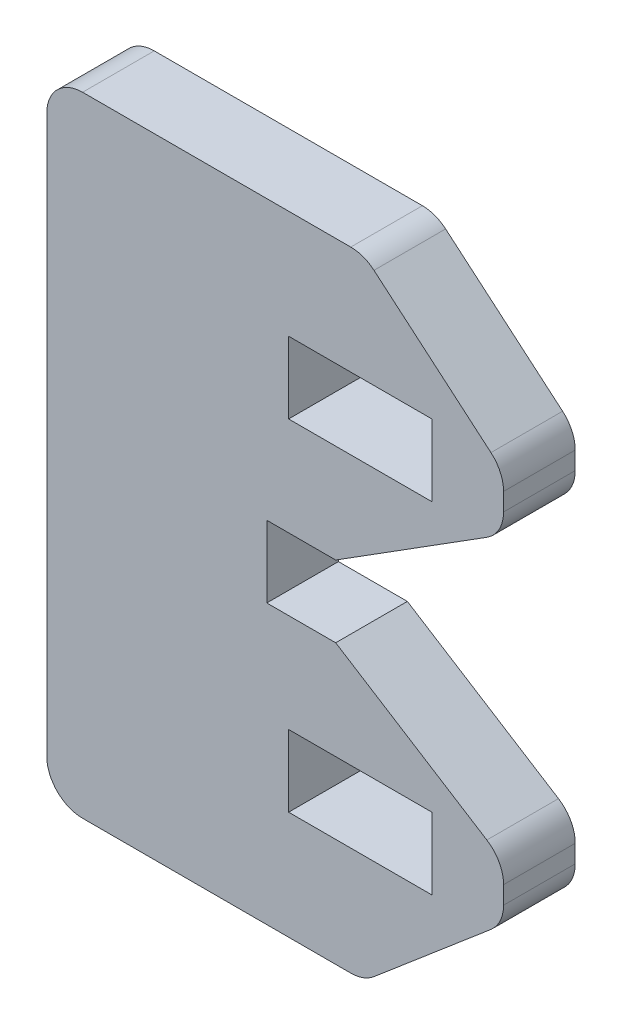
ISO-10303-21;
HEADER;
FILE_DESCRIPTION(('STEP AP214'),'2;1');
FILE_NAME('part.step','',(''),(''),'','','');
FILE_SCHEMA(('AUTOMOTIVE_DESIGN { 1 0 10303 214 1 1 1 1 }'));
ENDSEC;
DATA;
#1=APPLICATION_CONTEXT('core data for automotive mechanical design processes');
#2=APPLICATION_PROTOCOL_DEFINITION('international standard','automotive_design',2000,#1);
#3=PRODUCT_CONTEXT('',#1,'mechanical');
#4=PRODUCT('Part','Part','',(#3));
#5=PRODUCT_RELATED_PRODUCT_CATEGORY('part','',(#4));
#6=PRODUCT_DEFINITION_FORMATION('','',#4);
#7=PRODUCT_DEFINITION_CONTEXT('part definition',#1,'design');
#8=PRODUCT_DEFINITION('design','',#6,#7);
#9=PRODUCT_DEFINITION_SHAPE('','',#8);
#10=(LENGTH_UNIT() NAMED_UNIT(*) SI_UNIT(.MILLI.,.METRE.));
#11=(NAMED_UNIT(*) PLANE_ANGLE_UNIT() SI_UNIT($,.RADIAN.));
#12=(NAMED_UNIT(*) SI_UNIT($,.STERADIAN.) SOLID_ANGLE_UNIT());
#13=UNCERTAINTY_MEASURE_WITH_UNIT(LENGTH_MEASURE(1.E-05),#10,'distance_accuracy_value','');
#14=(GEOMETRIC_REPRESENTATION_CONTEXT(3) GLOBAL_UNCERTAINTY_ASSIGNED_CONTEXT((#13)) GLOBAL_UNIT_ASSIGNED_CONTEXT((#10,
#11,#12)) REPRESENTATION_CONTEXT('',''));
#15=CARTESIAN_POINT('',(0.,0.,0.));
#16=DIRECTION('',(0.,0.,1.));
#17=DIRECTION('',(1.,0.,0.));
#18=AXIS2_PLACEMENT_3D('',#15,#16,#17);
#19=CARTESIAN_POINT('',(75.9087412259888,2.67038995588559,1.524));
#20=DIRECTION('',(0.,0.,1.));
#21=DIRECTION('',(1.,0.,0.));
#22=AXIS2_PLACEMENT_3D('',#19,#20,#21);
#23=PLANE('',#22);
#24=DIRECTION('',(1.,0.,0.));
#25=VECTOR('',#24,1.);
#26=CARTESIAN_POINT('',(75.1467412259888,-5.14564233565694,1.524));
#27=LINE('',#26,#25);
#28=CARTESIAN_POINT('',(72.0987412259888,-5.14564233565695,1.524));
#29=VERTEX_POINT('',#28);
#30=CARTESIAN_POINT('',(75.1467412259888,-5.14564233565694,1.524));
#31=VERTEX_POINT('',#30);
#32=EDGE_CURVE('E255',#29,#31,#27,.T.);
#33=ORIENTED_EDGE('',*,*,#32,.F.);
#34=DIRECTION('',(0.,-1.,0.));
#35=VECTOR('',#34,1.);
#36=CARTESIAN_POINT('',(72.0987412259888,-5.14564233565695,1.524));
#37=LINE('',#36,#35);
#38=CARTESIAN_POINT('',(72.0987412259888,-3.62164233565695,1.524));
#39=VERTEX_POINT('',#38);
#40=EDGE_CURVE('E253',#39,#29,#37,.T.);
#41=ORIENTED_EDGE('',*,*,#40,.F.);
#42=DIRECTION('',(-1.,0.,0.));
#43=VECTOR('',#42,1.);
#44=CARTESIAN_POINT('',(75.1467412259888,-3.62164233565694,1.524));
#45=LINE('',#44,#43);
#46=CARTESIAN_POINT('',(75.1467412259888,-3.62164233565694,1.524));
#47=VERTEX_POINT('',#46);
#48=EDGE_CURVE('E261',#47,#39,#45,.T.);
#49=ORIENTED_EDGE('',*,*,#48,.F.);
#50=DIRECTION('',(0.,1.,0.));
#51=VECTOR('',#50,1.);
#52=CARTESIAN_POINT('',(75.1467412259888,-5.14564233565694,1.524));
#53=LINE('',#52,#51);
#54=EDGE_CURVE('E258',#31,#47,#53,.T.);
#55=ORIENTED_EDGE('',*,*,#54,.F.);
#56=EDGE_LOOP('',(#33,#41,#49,#55));
#57=FACE_BOUND('',#56,.T.);
#58=DIRECTION('',(0.,1.,0.));
#59=VECTOR('',#58,1.);
#60=CARTESIAN_POINT('',(71.6339660284306,-1.524,1.524));
#61=LINE('',#60,#59);
#62=CARTESIAN_POINT('',(71.6339660284306,-1.524,1.524));
#63=VERTEX_POINT('',#62);
#64=CARTESIAN_POINT('',(71.6339660284306,0.,1.524));
#65=VERTEX_POINT('',#64);
#66=EDGE_CURVE('E284',#63,#65,#61,.T.);
#67=ORIENTED_EDGE('',*,*,#66,.T.);
#68=DIRECTION('',(1.,0.,0.));
#69=VECTOR('',#68,1.);
#70=CARTESIAN_POINT('',(73.1003700758274,0.,1.524));
#71=LINE('',#70,#69);
#72=CARTESIAN_POINT('',(73.1003700758274,0.,1.524));
#73=VERTEX_POINT('',#72);
#74=EDGE_CURVE('E287',#65,#73,#71,.T.);
#75=ORIENTED_EDGE('',*,*,#74,.T.);
#76=DIRECTION('',(0.846031649720717,0.533132673610277,0.));
#77=VECTOR('',#76,1.);
#78=CARTESIAN_POINT('',(73.1003700758274,0.,1.524));
#79=LINE('',#78,#77);
#80=CARTESIAN_POINT('',(76.3149883232798,2.0257138387984,1.524));
#81=VERTEX_POINT('',#80);
#82=EDGE_CURVE('E290',#73,#81,#79,.T.);
#83=ORIENTED_EDGE('',*,*,#82,.T.);
#84=CARTESIAN_POINT('',(75.9087412259888,2.67038995588559,1.524));
#85=DIRECTION('',(0.,0.,1.));
#86=DIRECTION('',(1.,0.,0.));
#87=AXIS2_PLACEMENT_3D('',#84,#85,#86);
#88=CIRCLE('',#87,0.762000000000007);
#89=CARTESIAN_POINT('',(76.6707412259888,2.67038995588559,1.524));
#90=VERTEX_POINT('',#89);
#91=EDGE_CURVE('E292',#81,#90,#88,.T.);
#92=ORIENTED_EDGE('',*,*,#91,.T.);
#93=DIRECTION('',(0.,1.,0.));
#94=VECTOR('',#93,1.);
#95=CARTESIAN_POINT('',(76.6707412259888,2.67038995588559,1.524));
#96=LINE('',#95,#94);
#97=CARTESIAN_POINT('',(76.6707412259888,3.0488947154283,1.524));
#98=VERTEX_POINT('',#97);
#99=EDGE_CURVE('E294',#90,#98,#96,.T.);
#100=ORIENTED_EDGE('',*,*,#99,.T.);
#101=CARTESIAN_POINT('',(75.9087412259888,3.0488947154283,1.524));
#102=DIRECTION('',(0.,0.,1.));
#103=DIRECTION('',(1.,0.,0.));
#104=AXIS2_PLACEMENT_3D('',#101,#102,#103);
#105=CIRCLE('',#104,0.762000000000005);
#106=CARTESIAN_POINT('',(76.4021208794432,3.62960162735309,1.524));
#107=VERTEX_POINT('',#106);
#108=EDGE_CURVE('E296',#98,#107,#105,.T.);
#109=ORIENTED_EDGE('',*,*,#108,.T.);
#110=DIRECTION('',(-0.76208256158109,0.647479860176364,0.));
#111=VECTOR('',#110,1.);
#112=CARTESIAN_POINT('',(76.4021208794432,3.62960162735309,1.524));
#113=LINE('',#112,#111);
#114=CARTESIAN_POINT('',(73.9140783185866,5.74348997833968,1.524));
#115=VERTEX_POINT('',#114);
#116=EDGE_CURVE('E298',#107,#115,#113,.T.);
#117=ORIENTED_EDGE('',*,*,#116,.T.);
#118=CARTESIAN_POINT('',(73.4206986651322,5.16278306641489,1.524));
#119=DIRECTION('',(0.,0.,1.));
#120=DIRECTION('',(1.,0.,0.));
#121=AXIS2_PLACEMENT_3D('',#118,#119,#120);
#122=CIRCLE('',#121,0.762000000000003);
#123=CARTESIAN_POINT('',(73.4206986651322,5.92478306641488,1.524));
#124=VERTEX_POINT('',#123);
#125=EDGE_CURVE('E300',#115,#124,#122,.T.);
#126=ORIENTED_EDGE('',*,*,#125,.T.);
#127=DIRECTION('',(-1.,0.,0.));
#128=VECTOR('',#127,1.);
#129=CARTESIAN_POINT('',(73.4206986651322,5.92478306641488,1.524));
#130=LINE('',#129,#128);
#131=CARTESIAN_POINT('',(67.7169854717539,5.92478306641489,1.524));
#132=VERTEX_POINT('',#131);
#133=EDGE_CURVE('E302',#124,#132,#130,.T.);
#134=ORIENTED_EDGE('',*,*,#133,.T.);
#135=CARTESIAN_POINT('',(67.7169854717539,5.16278306641489,1.524));
#136=DIRECTION('',(0.,0.,1.));
#137=DIRECTION('',(1.,0.,0.));
#138=AXIS2_PLACEMENT_3D('',#135,#136,#137);
#139=CIRCLE('',#138,0.761999999999999);
#140=CARTESIAN_POINT('',(66.9549854717539,5.16278306641489,1.524));
#141=VERTEX_POINT('',#140);
#142=EDGE_CURVE('E304',#132,#141,#139,.T.);
#143=ORIENTED_EDGE('',*,*,#142,.T.);
#144=DIRECTION('',(0.,-1.,0.));
#145=VECTOR('',#144,1.);
#146=CARTESIAN_POINT('',(66.9549854717539,5.16278306641489,1.524));
#147=LINE('',#146,#145);
#148=CARTESIAN_POINT('',(66.9549854717539,-6.68678306641489,1.524));
#149=VERTEX_POINT('',#148);
#150=EDGE_CURVE('E306',#141,#149,#147,.T.);
#151=ORIENTED_EDGE('',*,*,#150,.T.);
#152=CARTESIAN_POINT('',(67.7169854717539,-6.6867830664149,1.524));
#153=DIRECTION('',(0.,0.,1.));
#154=DIRECTION('',(-1.,0.,0.));
#155=AXIS2_PLACEMENT_3D('',#152,#153,#154);
#156=CIRCLE('',#155,0.761999999999998);
#157=CARTESIAN_POINT('',(67.7169854717539,-7.44878306641489,1.524));
#158=VERTEX_POINT('',#157);
#159=EDGE_CURVE('E308',#149,#158,#156,.T.);
#160=ORIENTED_EDGE('',*,*,#159,.T.);
#161=DIRECTION('',(1.,0.,0.));
#162=VECTOR('',#161,1.);
#163=CARTESIAN_POINT('',(73.4206986651322,-7.44878306641489,1.524));
#164=LINE('',#163,#162);
#165=CARTESIAN_POINT('',(73.4206986651322,-7.4487830664149,1.524));
#166=VERTEX_POINT('',#165);
#167=EDGE_CURVE('E310',#158,#166,#164,.T.);
#168=ORIENTED_EDGE('',*,*,#167,.T.);
#169=CARTESIAN_POINT('',(73.4206986651322,-6.68678306641489,1.524));
#170=DIRECTION('',(0.,0.,1.));
#171=DIRECTION('',(-1.,0.,0.));
#172=AXIS2_PLACEMENT_3D('',#169,#170,#171);
#173=CIRCLE('',#172,0.762000000000009);
#174=CARTESIAN_POINT('',(73.9140783185866,-7.26748997833969,1.524));
#175=VERTEX_POINT('',#174);
#176=EDGE_CURVE('E312',#166,#175,#173,.T.);
#177=ORIENTED_EDGE('',*,*,#176,.T.);
#178=DIRECTION('',(0.762082561581091,0.647479860176363,0.));
#179=VECTOR('',#178,1.);
#180=CARTESIAN_POINT('',(76.4021208794432,-5.1536016273531,1.524));
#181=LINE('',#180,#179);
#182=CARTESIAN_POINT('',(76.4021208794432,-5.15360162735309,1.524));
#183=VERTEX_POINT('',#182);
#184=EDGE_CURVE('E314',#175,#183,#181,.T.);
#185=ORIENTED_EDGE('',*,*,#184,.T.);
#186=CARTESIAN_POINT('',(75.9087412259888,-4.5728947154283,1.524));
#187=DIRECTION('',(0.,0.,1.));
#188=DIRECTION('',(-1.,0.,0.));
#189=AXIS2_PLACEMENT_3D('',#186,#187,#188);
#190=CIRCLE('',#189,0.762000000000002);
#191=CARTESIAN_POINT('',(76.6707412259888,-4.5728947154283,1.524));
#192=VERTEX_POINT('',#191);
#193=EDGE_CURVE('E316',#183,#192,#190,.T.);
#194=ORIENTED_EDGE('',*,*,#193,.T.);
#195=DIRECTION('',(0.,1.,0.));
#196=VECTOR('',#195,1.);
#197=CARTESIAN_POINT('',(76.6707412259888,-4.19438995588559,1.524));
#198=LINE('',#197,#196);
#199=CARTESIAN_POINT('',(76.6707412259888,-4.19438995588559,1.524));
#200=VERTEX_POINT('',#199);
#201=EDGE_CURVE('E318',#192,#200,#198,.T.);
#202=ORIENTED_EDGE('',*,*,#201,.T.);
#203=CARTESIAN_POINT('',(75.9087412259888,-4.19438995588559,1.524));
#204=DIRECTION('',(0.,0.,1.));
#205=DIRECTION('',(-1.,0.,0.));
#206=AXIS2_PLACEMENT_3D('',#203,#204,#205);
#207=CIRCLE('',#206,0.762);
#208=CARTESIAN_POINT('',(76.3149883232798,-3.5497138387984,1.524));
#209=VERTEX_POINT('',#208);
#210=EDGE_CURVE('E320',#200,#209,#207,.T.);
#211=ORIENTED_EDGE('',*,*,#210,.T.);
#212=DIRECTION('',(-0.846031649720717,0.533132673610277,0.));
#213=VECTOR('',#212,1.);
#214=CARTESIAN_POINT('',(73.1003700758274,-1.524,1.524));
#215=LINE('',#214,#213);
#216=CARTESIAN_POINT('',(73.1003700758274,-1.524,1.524));
#217=VERTEX_POINT('',#216);
#218=EDGE_CURVE('E322',#209,#217,#215,.T.);
#219=ORIENTED_EDGE('',*,*,#218,.T.);
#220=DIRECTION('',(-1.,0.,0.));
#221=VECTOR('',#220,1.);
#222=CARTESIAN_POINT('',(71.6339660284306,-1.524,1.524));
#223=LINE('',#222,#221);
#224=EDGE_CURVE('E324',#217,#63,#223,.T.);
#225=ORIENTED_EDGE('',*,*,#224,.T.);
#226=EDGE_LOOP('',(#67,#75,#83,#92,#100,#109,#117,#126,#134,#143,#151,#160,#168,#177,#185,#194,
#202,#211,#219,#225));
#227=FACE_BOUND('',#226,.T.);
#228=DIRECTION('',(0.,-1.,0.));
#229=VECTOR('',#228,1.);
#230=CARTESIAN_POINT('',(72.0987412259888,3.62164233565694,1.524));
#231=LINE('',#230,#229);
#232=CARTESIAN_POINT('',(72.0987412259888,3.62164233565694,1.524));
#233=VERTEX_POINT('',#232);
#234=CARTESIAN_POINT('',(72.0987412259888,2.09764233565695,1.524));
#235=VERTEX_POINT('',#234);
#236=EDGE_CURVE('E225',#233,#235,#231,.T.);
#237=ORIENTED_EDGE('',*,*,#236,.F.);
#238=DIRECTION('',(-1.,0.,0.));
#239=VECTOR('',#238,1.);
#240=CARTESIAN_POINT('',(75.1467412259888,3.62164233565694,1.524));
#241=LINE('',#240,#239);
#242=CARTESIAN_POINT('',(75.1467412259888,3.62164233565694,1.524));
#243=VERTEX_POINT('',#242);
#244=EDGE_CURVE('E217',#243,#233,#241,.T.);
#245=ORIENTED_EDGE('',*,*,#244,.F.);
#246=DIRECTION('',(0.,1.,0.));
#247=VECTOR('',#246,1.);
#248=CARTESIAN_POINT('',(75.1467412259888,3.62164233565694,1.524));
#249=LINE('',#248,#247);
#250=CARTESIAN_POINT('',(75.1467412259888,2.09764233565694,1.524));
#251=VERTEX_POINT('',#250);
#252=EDGE_CURVE('E239',#251,#243,#249,.T.);
#253=ORIENTED_EDGE('',*,*,#252,.F.);
#254=DIRECTION('',(1.,0.,0.));
#255=VECTOR('',#254,1.);
#256=CARTESIAN_POINT('',(75.1467412259888,2.09764233565694,1.524));
#257=LINE('',#256,#255);
#258=EDGE_CURVE('E237',#235,#251,#257,.T.);
#259=ORIENTED_EDGE('',*,*,#258,.F.);
#260=EDGE_LOOP('',(#237,#245,#253,#259));
#261=FACE_BOUND('',#260,.T.);
#262=ADVANCED_FACE('F32',(#57,#227,#261),#23,.T.);
#263=CARTESIAN_POINT('',(75.9087412259888,2.67038995588559,0.));
#264=DIRECTION('',(0.,0.,1.));
#265=DIRECTION('',(1.,0.,0.));
#266=AXIS2_PLACEMENT_3D('',#263,#264,#265);
#267=PLANE('',#266);
#268=DIRECTION('',(0.,-1.,0.));
#269=VECTOR('',#268,1.);
#270=CARTESIAN_POINT('',(72.0987412259888,-5.14564233565695,0.));
#271=LINE('',#270,#269);
#272=CARTESIAN_POINT('',(72.0987412259888,-3.62164233565695,0.));
#273=VERTEX_POINT('',#272);
#274=CARTESIAN_POINT('',(72.0987412259888,-5.14564233565695,0.));
#275=VERTEX_POINT('',#274);
#276=EDGE_CURVE('E233',#273,#275,#271,.T.);
#277=ORIENTED_EDGE('',*,*,#276,.T.);
#278=DIRECTION('',(1.,0.,0.));
#279=VECTOR('',#278,1.);
#280=CARTESIAN_POINT('',(75.1467412259888,-5.14564233565694,0.));
#281=LINE('',#280,#279);
#282=CARTESIAN_POINT('',(75.1467412259888,-5.14564233565694,0.));
#283=VERTEX_POINT('',#282);
#284=EDGE_CURVE('E266',#275,#283,#281,.T.);
#285=ORIENTED_EDGE('',*,*,#284,.T.);
#286=DIRECTION('',(0.,1.,0.));
#287=VECTOR('',#286,1.);
#288=CARTESIAN_POINT('',(75.1467412259888,-5.14564233565694,0.));
#289=LINE('',#288,#287);
#290=CARTESIAN_POINT('',(75.1467412259888,-3.62164233565694,0.));
#291=VERTEX_POINT('',#290);
#292=EDGE_CURVE('E269',#283,#291,#289,.T.);
#293=ORIENTED_EDGE('',*,*,#292,.T.);
#294=DIRECTION('',(-1.,0.,0.));
#295=VECTOR('',#294,1.);
#296=CARTESIAN_POINT('',(75.1467412259888,-3.62164233565694,0.));
#297=LINE('',#296,#295);
#298=EDGE_CURVE('E256',#291,#273,#297,.T.);
#299=ORIENTED_EDGE('',*,*,#298,.T.);
#300=EDGE_LOOP('',(#277,#285,#293,#299));
#301=FACE_BOUND('',#300,.T.);
#302=DIRECTION('',(0.,1.,0.));
#303=VECTOR('',#302,1.);
#304=CARTESIAN_POINT('',(71.6339660284306,-1.524,0.));
#305=LINE('',#304,#303);
#306=CARTESIAN_POINT('',(71.6339660284306,-1.524,0.));
#307=VERTEX_POINT('',#306);
#308=CARTESIAN_POINT('',(71.6339660284306,0.,0.));
#309=VERTEX_POINT('',#308);
#310=EDGE_CURVE('E283',#307,#309,#305,.T.);
#311=ORIENTED_EDGE('',*,*,#310,.F.);
#312=DIRECTION('',(-1.,0.,0.));
#313=VECTOR('',#312,1.);
#314=CARTESIAN_POINT('',(71.6339660284306,-1.524,0.));
#315=LINE('',#314,#313);
#316=CARTESIAN_POINT('',(73.1003700758274,-1.524,0.));
#317=VERTEX_POINT('',#316);
#318=EDGE_CURVE('E288',#317,#307,#315,.T.);
#319=ORIENTED_EDGE('',*,*,#318,.F.);
#320=DIRECTION('',(-0.846031649720717,0.533132673610277,0.));
#321=VECTOR('',#320,1.);
#322=CARTESIAN_POINT('',(73.1003700758274,-1.524,0.));
#323=LINE('',#322,#321);
#324=CARTESIAN_POINT('',(76.3149883232798,-3.5497138387984,0.));
#325=VERTEX_POINT('',#324);
#326=EDGE_CURVE('E363',#325,#317,#323,.T.);
#327=ORIENTED_EDGE('',*,*,#326,.F.);
#328=CARTESIAN_POINT('',(75.9087412259888,-4.19438995588559,0.));
#329=DIRECTION('',(0.,0.,1.));
#330=DIRECTION('',(-1.,0.,0.));
#331=AXIS2_PLACEMENT_3D('',#328,#329,#330);
#332=CIRCLE('',#331,0.762);
#333=CARTESIAN_POINT('',(76.6707412259888,-4.19438995588559,0.));
#334=VERTEX_POINT('',#333);
#335=EDGE_CURVE('E361',#334,#325,#332,.T.);
#336=ORIENTED_EDGE('',*,*,#335,.F.);
#337=DIRECTION('',(0.,1.,0.));
#338=VECTOR('',#337,1.);
#339=CARTESIAN_POINT('',(76.6707412259888,-4.19438995588559,0.));
#340=LINE('',#339,#338);
#341=CARTESIAN_POINT('',(76.6707412259888,-4.5728947154283,0.));
#342=VERTEX_POINT('',#341);
#343=EDGE_CURVE('E359',#342,#334,#340,.T.);
#344=ORIENTED_EDGE('',*,*,#343,.F.);
#345=CARTESIAN_POINT('',(75.9087412259888,-4.5728947154283,0.));
#346=DIRECTION('',(0.,0.,1.));
#347=DIRECTION('',(-1.,0.,0.));
#348=AXIS2_PLACEMENT_3D('',#345,#346,#347);
#349=CIRCLE('',#348,0.762000000000002);
#350=CARTESIAN_POINT('',(76.4021208794432,-5.15360162735309,0.));
#351=VERTEX_POINT('',#350);
#352=EDGE_CURVE('E357',#351,#342,#349,.T.);
#353=ORIENTED_EDGE('',*,*,#352,.F.);
#354=DIRECTION('',(0.762082561581091,0.647479860176363,0.));
#355=VECTOR('',#354,1.);
#356=CARTESIAN_POINT('',(76.4021208794432,-5.1536016273531,0.));
#357=LINE('',#356,#355);
#358=CARTESIAN_POINT('',(73.9140783185866,-7.26748997833969,0.));
#359=VERTEX_POINT('',#358);
#360=EDGE_CURVE('E355',#359,#351,#357,.T.);
#361=ORIENTED_EDGE('',*,*,#360,.F.);
#362=CARTESIAN_POINT('',(73.4206986651322,-6.68678306641489,0.));
#363=DIRECTION('',(0.,0.,1.));
#364=DIRECTION('',(-1.,0.,0.));
#365=AXIS2_PLACEMENT_3D('',#362,#363,#364);
#366=CIRCLE('',#365,0.762000000000009);
#367=CARTESIAN_POINT('',(73.4206986651322,-7.4487830664149,0.));
#368=VERTEX_POINT('',#367);
#369=EDGE_CURVE('E353',#368,#359,#366,.T.);
#370=ORIENTED_EDGE('',*,*,#369,.F.);
#371=DIRECTION('',(1.,0.,0.));
#372=VECTOR('',#371,1.);
#373=CARTESIAN_POINT('',(73.4206986651322,-7.44878306641489,0.));
#374=LINE('',#373,#372);
#375=CARTESIAN_POINT('',(67.7169854717539,-7.44878306641489,0.));
#376=VERTEX_POINT('',#375);
#377=EDGE_CURVE('E351',#376,#368,#374,.T.);
#378=ORIENTED_EDGE('',*,*,#377,.F.);
#379=CARTESIAN_POINT('',(67.7169854717539,-6.6867830664149,0.));
#380=DIRECTION('',(0.,0.,1.));
#381=DIRECTION('',(-1.,0.,0.));
#382=AXIS2_PLACEMENT_3D('',#379,#380,#381);
#383=CIRCLE('',#382,0.761999999999998);
#384=CARTESIAN_POINT('',(66.9549854717539,-6.68678306641489,0.));
#385=VERTEX_POINT('',#384);
#386=EDGE_CURVE('E349',#385,#376,#383,.T.);
#387=ORIENTED_EDGE('',*,*,#386,.F.);
#388=DIRECTION('',(0.,-1.,0.));
#389=VECTOR('',#388,1.);
#390=CARTESIAN_POINT('',(66.9549854717539,5.16278306641489,0.));
#391=LINE('',#390,#389);
#392=CARTESIAN_POINT('',(66.9549854717539,5.16278306641489,0.));
#393=VERTEX_POINT('',#392);
#394=EDGE_CURVE('E347',#393,#385,#391,.T.);
#395=ORIENTED_EDGE('',*,*,#394,.F.);
#396=CARTESIAN_POINT('',(67.7169854717539,5.16278306641489,0.));
#397=DIRECTION('',(0.,0.,1.));
#398=DIRECTION('',(1.,0.,0.));
#399=AXIS2_PLACEMENT_3D('',#396,#397,#398);
#400=CIRCLE('',#399,0.761999999999999);
#401=CARTESIAN_POINT('',(67.7169854717539,5.92478306641489,0.));
#402=VERTEX_POINT('',#401);
#403=EDGE_CURVE('E345',#402,#393,#400,.T.);
#404=ORIENTED_EDGE('',*,*,#403,.F.);
#405=DIRECTION('',(-1.,0.,0.));
#406=VECTOR('',#405,1.);
#407=CARTESIAN_POINT('',(73.4206986651322,5.92478306641488,0.));
#408=LINE('',#407,#406);
#409=CARTESIAN_POINT('',(73.4206986651322,5.92478306641488,0.));
#410=VERTEX_POINT('',#409);
#411=EDGE_CURVE('E343',#410,#402,#408,.T.);
#412=ORIENTED_EDGE('',*,*,#411,.F.);
#413=CARTESIAN_POINT('',(73.4206986651322,5.16278306641489,0.));
#414=DIRECTION('',(0.,0.,1.));
#415=DIRECTION('',(1.,0.,0.));
#416=AXIS2_PLACEMENT_3D('',#413,#414,#415);
#417=CIRCLE('',#416,0.762000000000003);
#418=CARTESIAN_POINT('',(73.9140783185866,5.74348997833968,0.));
#419=VERTEX_POINT('',#418);
#420=EDGE_CURVE('E341',#419,#410,#417,.T.);
#421=ORIENTED_EDGE('',*,*,#420,.F.);
#422=DIRECTION('',(-0.76208256158109,0.647479860176364,0.));
#423=VECTOR('',#422,1.);
#424=CARTESIAN_POINT('',(76.4021208794432,3.62960162735309,0.));
#425=LINE('',#424,#423);
#426=CARTESIAN_POINT('',(76.4021208794432,3.62960162735309,0.));
#427=VERTEX_POINT('',#426);
#428=EDGE_CURVE('E339',#427,#419,#425,.T.);
#429=ORIENTED_EDGE('',*,*,#428,.F.);
#430=CARTESIAN_POINT('',(75.9087412259888,3.0488947154283,0.));
#431=DIRECTION('',(0.,0.,1.));
#432=DIRECTION('',(1.,0.,0.));
#433=AXIS2_PLACEMENT_3D('',#430,#431,#432);
#434=CIRCLE('',#433,0.762000000000005);
#435=CARTESIAN_POINT('',(76.6707412259888,3.0488947154283,0.));
#436=VERTEX_POINT('',#435);
#437=EDGE_CURVE('E337',#436,#427,#434,.T.);
#438=ORIENTED_EDGE('',*,*,#437,.F.);
#439=DIRECTION('',(0.,1.,0.));
#440=VECTOR('',#439,1.);
#441=CARTESIAN_POINT('',(76.6707412259888,2.67038995588559,0.));
#442=LINE('',#441,#440);
#443=CARTESIAN_POINT('',(76.6707412259888,2.67038995588559,0.));
#444=VERTEX_POINT('',#443);
#445=EDGE_CURVE('E335',#444,#436,#442,.T.);
#446=ORIENTED_EDGE('',*,*,#445,.F.);
#447=CARTESIAN_POINT('',(75.9087412259888,2.67038995588559,0.));
#448=DIRECTION('',(0.,0.,1.));
#449=DIRECTION('',(1.,0.,0.));
#450=AXIS2_PLACEMENT_3D('',#447,#448,#449);
#451=CIRCLE('',#450,0.762000000000007);
#452=CARTESIAN_POINT('',(76.3149883232798,2.0257138387984,0.));
#453=VERTEX_POINT('',#452);
#454=EDGE_CURVE('E333',#453,#444,#451,.T.);
#455=ORIENTED_EDGE('',*,*,#454,.F.);
#456=DIRECTION('',(0.846031649720717,0.533132673610277,0.));
#457=VECTOR('',#456,1.);
#458=CARTESIAN_POINT('',(73.1003700758274,0.,0.));
#459=LINE('',#458,#457);
#460=CARTESIAN_POINT('',(73.1003700758274,0.,0.));
#461=VERTEX_POINT('',#460);
#462=EDGE_CURVE('E331',#461,#453,#459,.T.);
#463=ORIENTED_EDGE('',*,*,#462,.F.);
#464=DIRECTION('',(1.,0.,0.));
#465=VECTOR('',#464,1.);
#466=CARTESIAN_POINT('',(73.1003700758274,0.,0.));
#467=LINE('',#466,#465);
#468=EDGE_CURVE('E329',#309,#461,#467,.T.);
#469=ORIENTED_EDGE('',*,*,#468,.F.);
#470=EDGE_LOOP('',(#311,#319,#327,#336,#344,#353,#361,#370,#378,#387,#395,#404,#412,#421,#429,
#438,#446,#455,#463,#469));
#471=FACE_BOUND('',#470,.T.);
#472=DIRECTION('',(-1.,0.,0.));
#473=VECTOR('',#472,1.);
#474=CARTESIAN_POINT('',(75.1467412259888,3.62164233565694,0.));
#475=LINE('',#474,#473);
#476=CARTESIAN_POINT('',(75.1467412259888,3.62164233565694,0.));
#477=VERTEX_POINT('',#476);
#478=CARTESIAN_POINT('',(72.0987412259888,3.62164233565694,0.));
#479=VERTEX_POINT('',#478);
#480=EDGE_CURVE('E55',#477,#479,#475,.T.);
#481=ORIENTED_EDGE('',*,*,#480,.T.);
#482=DIRECTION('',(0.,-1.,0.));
#483=VECTOR('',#482,1.);
#484=CARTESIAN_POINT('',(72.0987412259888,3.62164233565694,0.));
#485=LINE('',#484,#483);
#486=CARTESIAN_POINT('',(72.0987412259888,2.09764233565695,0.));
#487=VERTEX_POINT('',#486);
#488=EDGE_CURVE('E232',#479,#487,#485,.T.);
#489=ORIENTED_EDGE('',*,*,#488,.T.);
#490=DIRECTION('',(1.,0.,0.));
#491=VECTOR('',#490,1.);
#492=CARTESIAN_POINT('',(75.1467412259888,2.09764233565694,0.));
#493=LINE('',#492,#491);
#494=CARTESIAN_POINT('',(75.1467412259888,2.09764233565694,0.));
#495=VERTEX_POINT('',#494);
#496=EDGE_CURVE('E245',#487,#495,#493,.T.);
#497=ORIENTED_EDGE('',*,*,#496,.T.);
#498=DIRECTION('',(0.,1.,0.));
#499=VECTOR('',#498,1.);
#500=CARTESIAN_POINT('',(75.1467412259888,3.62164233565694,0.));
#501=LINE('',#500,#499);
#502=EDGE_CURVE('E226',#495,#477,#501,.T.);
#503=ORIENTED_EDGE('',*,*,#502,.T.);
#504=EDGE_LOOP('',(#481,#489,#497,#503));
#505=FACE_BOUND('',#504,.T.);
#506=ADVANCED_FACE('F429',(#301,#471,#505),#267,.F.);
#507=CARTESIAN_POINT('',(71.6339660284306,-1.524,1.524));
#508=DIRECTION('',(-1.,0.,0.));
#509=DIRECTION('',(0.,0.,1.));
#510=AXIS2_PLACEMENT_3D('',#507,#508,#509);
#511=PLANE('',#510);
#512=ORIENTED_EDGE('',*,*,#310,.T.);
#513=DIRECTION('',(0.,0.,-1.));
#514=VECTOR('',#513,1.);
#515=CARTESIAN_POINT('',(71.6339660284306,0.,1.524));
#516=LINE('',#515,#514);
#517=EDGE_CURVE('E11',#65,#309,#516,.T.);
#518=ORIENTED_EDGE('',*,*,#517,.F.);
#519=ORIENTED_EDGE('',*,*,#66,.F.);
#520=DIRECTION('',(0.,0.,-1.));
#521=VECTOR('',#520,1.);
#522=CARTESIAN_POINT('',(71.6339660284306,-1.524,1.524));
#523=LINE('',#522,#521);
#524=EDGE_CURVE('E326',#63,#307,#523,.T.);
#525=ORIENTED_EDGE('',*,*,#524,.T.);
#526=EDGE_LOOP('',(#512,#518,#519,#525));
#527=FACE_BOUND('',#526,.T.);
#528=ADVANCED_FACE('F34',(#527),#511,.F.);
#529=CARTESIAN_POINT('',(73.1003700758274,0.,1.524));
#530=DIRECTION('',(0.,1.,0.));
#531=DIRECTION('',(-1.,0.,0.));
#532=AXIS2_PLACEMENT_3D('',#529,#530,#531);
#533=PLANE('',#532);
#534=ORIENTED_EDGE('',*,*,#468,.T.);
#535=DIRECTION('',(0.,0.,-1.));
#536=VECTOR('',#535,1.);
#537=CARTESIAN_POINT('',(73.1003700758274,0.,1.524));
#538=LINE('',#537,#536);
#539=EDGE_CURVE('E40',#73,#461,#538,.T.);
#540=ORIENTED_EDGE('',*,*,#539,.F.);
#541=ORIENTED_EDGE('',*,*,#74,.F.);
#542=ORIENTED_EDGE('',*,*,#517,.T.);
#543=EDGE_LOOP('',(#534,#540,#541,#542));
#544=FACE_BOUND('',#543,.T.);
#545=ADVANCED_FACE('F446',(#544),#533,.F.);
#546=CARTESIAN_POINT('',(73.1003700758274,0.,1.524));
#547=DIRECTION('',(-0.533132673610277,0.846031649720717,0.));
#548=DIRECTION('',(-0.846031649720717,-0.533132673610277,0.));
#549=AXIS2_PLACEMENT_3D('',#546,#547,#548);
#550=PLANE('',#549);
#551=ORIENTED_EDGE('',*,*,#462,.T.);
#552=DIRECTION('',(0.,0.,-1.));
#553=VECTOR('',#552,1.);
#554=CARTESIAN_POINT('',(76.3149883232798,2.0257138387984,1.524));
#555=LINE('',#554,#553);
#556=EDGE_CURVE('E416',#81,#453,#555,.T.);
#557=ORIENTED_EDGE('',*,*,#556,.F.);
#558=ORIENTED_EDGE('',*,*,#82,.F.);
#559=ORIENTED_EDGE('',*,*,#539,.T.);
#560=EDGE_LOOP('',(#551,#557,#558,#559));
#561=FACE_BOUND('',#560,.T.);
#562=ADVANCED_FACE('F423',(#561),#550,.F.);
#563=CARTESIAN_POINT('',(75.9087412259888,2.67038995588559,1.524));
#564=DIRECTION('',(0.,0.,-1.));
#565=DIRECTION('',(-1.,0.,0.));
#566=AXIS2_PLACEMENT_3D('',#563,#564,#565);
#567=CYLINDRICAL_SURFACE('',#566,0.762000000000007);
#568=ORIENTED_EDGE('',*,*,#454,.T.);
#569=DIRECTION('',(0.,0.,-1.));
#570=VECTOR('',#569,1.);
#571=CARTESIAN_POINT('',(76.6707412259888,2.67038995588559,1.524));
#572=LINE('',#571,#570);
#573=EDGE_CURVE('E413',#90,#444,#572,.T.);
#574=ORIENTED_EDGE('',*,*,#573,.F.);
#575=ORIENTED_EDGE('',*,*,#91,.F.);
#576=ORIENTED_EDGE('',*,*,#556,.T.);
#577=EDGE_LOOP('',(#568,#574,#575,#576));
#578=FACE_BOUND('',#577,.T.);
#579=ADVANCED_FACE('F435',(#578),#567,.T.);
#580=CARTESIAN_POINT('',(76.6707412259888,2.67038995588559,1.524));
#581=DIRECTION('',(-1.,0.,0.));
#582=DIRECTION('',(0.,0.,1.));
#583=AXIS2_PLACEMENT_3D('',#580,#581,#582);
#584=PLANE('',#583);
#585=ORIENTED_EDGE('',*,*,#445,.T.);
#586=DIRECTION('',(0.,0.,-1.));
#587=VECTOR('',#586,1.);
#588=CARTESIAN_POINT('',(76.6707412259888,3.0488947154283,1.524));
#589=LINE('',#588,#587);
#590=EDGE_CURVE('E410',#98,#436,#589,.T.);
#591=ORIENTED_EDGE('',*,*,#590,.F.);
#592=ORIENTED_EDGE('',*,*,#99,.F.);
#593=ORIENTED_EDGE('',*,*,#573,.T.);
#594=EDGE_LOOP('',(#585,#591,#592,#593));
#595=FACE_BOUND('',#594,.T.);
#596=ADVANCED_FACE('F439',(#595),#584,.F.);
#597=CARTESIAN_POINT('',(75.9087412259888,3.0488947154283,1.524));
#598=DIRECTION('',(0.,0.,-1.));
#599=DIRECTION('',(-1.,0.,0.));
#600=AXIS2_PLACEMENT_3D('',#597,#598,#599);
#601=CYLINDRICAL_SURFACE('',#600,0.762000000000005);
#602=ORIENTED_EDGE('',*,*,#437,.T.);
#603=DIRECTION('',(0.,0.,-1.));
#604=VECTOR('',#603,1.);
#605=CARTESIAN_POINT('',(76.4021208794432,3.62960162735309,1.524));
#606=LINE('',#605,#604);
#607=EDGE_CURVE('E407',#107,#427,#606,.T.);
#608=ORIENTED_EDGE('',*,*,#607,.F.);
#609=ORIENTED_EDGE('',*,*,#108,.F.);
#610=ORIENTED_EDGE('',*,*,#590,.T.);
#611=EDGE_LOOP('',(#602,#608,#609,#610));
#612=FACE_BOUND('',#611,.T.);
#613=ADVANCED_FACE('F519',(#612),#601,.T.);
#614=CARTESIAN_POINT('',(76.4021208794432,3.62960162735309,1.524));
#615=DIRECTION('',(-0.647479860176364,-0.76208256158109,0.));
#616=DIRECTION('',(0.762082561581091,-0.647479860176364,0.));
#617=AXIS2_PLACEMENT_3D('',#614,#615,#616);
#618=PLANE('',#617);
#619=ORIENTED_EDGE('',*,*,#428,.T.);
#620=DIRECTION('',(0.,0.,-1.));
#621=VECTOR('',#620,1.);
#622=CARTESIAN_POINT('',(73.9140783185866,5.74348997833968,1.524));
#623=LINE('',#622,#621);
#624=EDGE_CURVE('E404',#115,#419,#623,.T.);
#625=ORIENTED_EDGE('',*,*,#624,.F.);
#626=ORIENTED_EDGE('',*,*,#116,.F.);
#627=ORIENTED_EDGE('',*,*,#607,.T.);
#628=EDGE_LOOP('',(#619,#625,#626,#627));
#629=FACE_BOUND('',#628,.T.);
#630=ADVANCED_FACE('F517',(#629),#618,.F.);
#631=CARTESIAN_POINT('',(73.4206986651322,5.16278306641489,1.524));
#632=DIRECTION('',(0.,0.,-1.));
#633=DIRECTION('',(-1.,0.,0.));
#634=AXIS2_PLACEMENT_3D('',#631,#632,#633);
#635=CYLINDRICAL_SURFACE('',#634,0.762000000000003);
#636=ORIENTED_EDGE('',*,*,#420,.T.);
#637=DIRECTION('',(0.,0.,-1.));
#638=VECTOR('',#637,1.);
#639=CARTESIAN_POINT('',(73.4206986651322,5.92478306641488,1.524));
#640=LINE('',#639,#638);
#641=EDGE_CURVE('E401',#124,#410,#640,.T.);
#642=ORIENTED_EDGE('',*,*,#641,.F.);
#643=ORIENTED_EDGE('',*,*,#125,.F.);
#644=ORIENTED_EDGE('',*,*,#624,.T.);
#645=EDGE_LOOP('',(#636,#642,#643,#644));
#646=FACE_BOUND('',#645,.T.);
#647=ADVANCED_FACE('F512',(#646),#635,.T.);
#648=CARTESIAN_POINT('',(73.4206986651322,5.92478306641488,1.524));
#649=DIRECTION('',(0.,-1.,0.));
#650=DIRECTION('',(1.,0.,0.));
#651=AXIS2_PLACEMENT_3D('',#648,#649,#650);
#652=PLANE('',#651);
#653=ORIENTED_EDGE('',*,*,#411,.T.);
#654=DIRECTION('',(0.,0.,-1.));
#655=VECTOR('',#654,1.);
#656=CARTESIAN_POINT('',(67.7169854717539,5.92478306641489,1.524));
#657=LINE('',#656,#655);
#658=EDGE_CURVE('E398',#132,#402,#657,.T.);
#659=ORIENTED_EDGE('',*,*,#658,.F.);
#660=ORIENTED_EDGE('',*,*,#133,.F.);
#661=ORIENTED_EDGE('',*,*,#641,.T.);
#662=EDGE_LOOP('',(#653,#659,#660,#661));
#663=FACE_BOUND('',#662,.T.);
#664=ADVANCED_FACE('F507',(#663),#652,.F.);
#665=CARTESIAN_POINT('',(67.7169854717539,5.16278306641489,1.524));
#666=DIRECTION('',(0.,0.,-1.));
#667=DIRECTION('',(-1.,0.,0.));
#668=AXIS2_PLACEMENT_3D('',#665,#666,#667);
#669=CYLINDRICAL_SURFACE('',#668,0.761999999999999);
#670=ORIENTED_EDGE('',*,*,#403,.T.);
#671=DIRECTION('',(0.,0.,-1.));
#672=VECTOR('',#671,1.);
#673=CARTESIAN_POINT('',(66.9549854717539,5.16278306641489,1.524));
#674=LINE('',#673,#672);
#675=EDGE_CURVE('E395',#141,#393,#674,.T.);
#676=ORIENTED_EDGE('',*,*,#675,.F.);
#677=ORIENTED_EDGE('',*,*,#142,.F.);
#678=ORIENTED_EDGE('',*,*,#658,.T.);
#679=EDGE_LOOP('',(#670,#676,#677,#678));
#680=FACE_BOUND('',#679,.T.);
#681=ADVANCED_FACE('F503',(#680),#669,.T.);
#682=CARTESIAN_POINT('',(66.9549854717539,5.16278306641489,1.524));
#683=DIRECTION('',(1.,0.,0.));
#684=DIRECTION('',(0.,0.,-1.));
#685=AXIS2_PLACEMENT_3D('',#682,#683,#684);
#686=PLANE('',#685);
#687=ORIENTED_EDGE('',*,*,#394,.T.);
#688=DIRECTION('',(0.,0.,-1.));
#689=VECTOR('',#688,1.);
#690=CARTESIAN_POINT('',(66.9549854717539,-6.68678306641489,1.524));
#691=LINE('',#690,#689);
#692=EDGE_CURVE('E392',#149,#385,#691,.T.);
#693=ORIENTED_EDGE('',*,*,#692,.F.);
#694=ORIENTED_EDGE('',*,*,#150,.F.);
#695=ORIENTED_EDGE('',*,*,#675,.T.);
#696=EDGE_LOOP('',(#687,#693,#694,#695));
#697=FACE_BOUND('',#696,.T.);
#698=ADVANCED_FACE('F498',(#697),#686,.F.);
#699=CARTESIAN_POINT('',(67.7169854717539,-6.6867830664149,1.524));
#700=DIRECTION('',(0.,0.,-1.));
#701=DIRECTION('',(-1.,0.,0.));
#702=AXIS2_PLACEMENT_3D('',#699,#700,#701);
#703=CYLINDRICAL_SURFACE('',#702,0.761999999999998);
#704=ORIENTED_EDGE('',*,*,#386,.T.);
#705=DIRECTION('',(0.,0.,-1.));
#706=VECTOR('',#705,1.);
#707=CARTESIAN_POINT('',(67.7169854717539,-7.44878306641489,1.524));
#708=LINE('',#707,#706);
#709=EDGE_CURVE('E389',#158,#376,#708,.T.);
#710=ORIENTED_EDGE('',*,*,#709,.F.);
#711=ORIENTED_EDGE('',*,*,#159,.F.);
#712=ORIENTED_EDGE('',*,*,#692,.T.);
#713=EDGE_LOOP('',(#704,#710,#711,#712));
#714=FACE_BOUND('',#713,.T.);
#715=ADVANCED_FACE('F492',(#714),#703,.T.);
#716=CARTESIAN_POINT('',(73.4206986651322,-7.44878306641489,1.524));
#717=DIRECTION('',(0.,1.,0.));
#718=DIRECTION('',(-1.,0.,0.));
#719=AXIS2_PLACEMENT_3D('',#716,#717,#718);
#720=PLANE('',#719);
#721=ORIENTED_EDGE('',*,*,#377,.T.);
#722=DIRECTION('',(0.,0.,-1.));
#723=VECTOR('',#722,1.);
#724=CARTESIAN_POINT('',(73.4206986651322,-7.4487830664149,1.524));
#725=LINE('',#724,#723);
#726=EDGE_CURVE('E386',#166,#368,#725,.T.);
#727=ORIENTED_EDGE('',*,*,#726,.F.);
#728=ORIENTED_EDGE('',*,*,#167,.F.);
#729=ORIENTED_EDGE('',*,*,#709,.T.);
#730=EDGE_LOOP('',(#721,#727,#728,#729));
#731=FACE_BOUND('',#730,.T.);
#732=ADVANCED_FACE('F488',(#731),#720,.F.);
#733=CARTESIAN_POINT('',(73.4206986651322,-6.68678306641489,1.524));
#734=DIRECTION('',(0.,0.,-1.));
#735=DIRECTION('',(-1.,0.,0.));
#736=AXIS2_PLACEMENT_3D('',#733,#734,#735);
#737=CYLINDRICAL_SURFACE('',#736,0.762000000000009);
#738=ORIENTED_EDGE('',*,*,#369,.T.);
#739=DIRECTION('',(0.,0.,-1.));
#740=VECTOR('',#739,1.);
#741=CARTESIAN_POINT('',(73.9140783185866,-7.26748997833969,1.524));
#742=LINE('',#741,#740);
#743=EDGE_CURVE('E383',#175,#359,#742,.T.);
#744=ORIENTED_EDGE('',*,*,#743,.F.);
#745=ORIENTED_EDGE('',*,*,#176,.F.);
#746=ORIENTED_EDGE('',*,*,#726,.T.);
#747=EDGE_LOOP('',(#738,#744,#745,#746));
#748=FACE_BOUND('',#747,.T.);
#749=ADVANCED_FACE('F483',(#748),#737,.T.);
#750=CARTESIAN_POINT('',(76.4021208794432,-5.1536016273531,1.524));
#751=DIRECTION('',(-0.647479860176363,0.762082561581091,0.));
#752=DIRECTION('',(-0.762082561581091,-0.647479860176363,0.));
#753=AXIS2_PLACEMENT_3D('',#750,#751,#752);
#754=PLANE('',#753);
#755=ORIENTED_EDGE('',*,*,#360,.T.);
#756=DIRECTION('',(0.,0.,-1.));
#757=VECTOR('',#756,1.);
#758=CARTESIAN_POINT('',(76.4021208794432,-5.15360162735309,1.524));
#759=LINE('',#758,#757);
#760=EDGE_CURVE('E380',#183,#351,#759,.T.);
#761=ORIENTED_EDGE('',*,*,#760,.F.);
#762=ORIENTED_EDGE('',*,*,#184,.F.);
#763=ORIENTED_EDGE('',*,*,#743,.T.);
#764=EDGE_LOOP('',(#755,#761,#762,#763));
#765=FACE_BOUND('',#764,.T.);
#766=ADVANCED_FACE('F477',(#765),#754,.F.);
#767=CARTESIAN_POINT('',(75.9087412259888,-4.5728947154283,1.524));
#768=DIRECTION('',(0.,0.,-1.));
#769=DIRECTION('',(-1.,0.,0.));
#770=AXIS2_PLACEMENT_3D('',#767,#768,#769);
#771=CYLINDRICAL_SURFACE('',#770,0.762000000000002);
#772=ORIENTED_EDGE('',*,*,#352,.T.);
#773=DIRECTION('',(0.,0.,-1.));
#774=VECTOR('',#773,1.);
#775=CARTESIAN_POINT('',(76.6707412259888,-4.5728947154283,1.524));
#776=LINE('',#775,#774);
#777=EDGE_CURVE('E377',#192,#342,#776,.T.);
#778=ORIENTED_EDGE('',*,*,#777,.F.);
#779=ORIENTED_EDGE('',*,*,#193,.F.);
#780=ORIENTED_EDGE('',*,*,#760,.T.);
#781=EDGE_LOOP('',(#772,#778,#779,#780));
#782=FACE_BOUND('',#781,.T.);
#783=ADVANCED_FACE('F473',(#782),#771,.T.);
#784=CARTESIAN_POINT('',(76.6707412259888,-4.19438995588559,1.524));
#785=DIRECTION('',(-1.,0.,0.));
#786=DIRECTION('',(0.,0.,1.));
#787=AXIS2_PLACEMENT_3D('',#784,#785,#786);
#788=PLANE('',#787);
#789=ORIENTED_EDGE('',*,*,#343,.T.);
#790=DIRECTION('',(0.,0.,-1.));
#791=VECTOR('',#790,1.);
#792=CARTESIAN_POINT('',(76.6707412259888,-4.19438995588559,1.524));
#793=LINE('',#792,#791);
#794=EDGE_CURVE('E374',#200,#334,#793,.T.);
#795=ORIENTED_EDGE('',*,*,#794,.F.);
#796=ORIENTED_EDGE('',*,*,#201,.F.);
#797=ORIENTED_EDGE('',*,*,#777,.T.);
#798=EDGE_LOOP('',(#789,#795,#796,#797));
#799=FACE_BOUND('',#798,.T.);
#800=ADVANCED_FACE('F468',(#799),#788,.F.);
#801=CARTESIAN_POINT('',(75.9087412259888,-4.19438995588559,1.524));
#802=DIRECTION('',(0.,0.,-1.));
#803=DIRECTION('',(-1.,0.,0.));
#804=AXIS2_PLACEMENT_3D('',#801,#802,#803);
#805=CYLINDRICAL_SURFACE('',#804,0.762);
#806=ORIENTED_EDGE('',*,*,#335,.T.);
#807=DIRECTION('',(0.,0.,-1.));
#808=VECTOR('',#807,1.);
#809=CARTESIAN_POINT('',(76.3149883232798,-3.5497138387984,1.524));
#810=LINE('',#809,#808);
#811=EDGE_CURVE('E371',#209,#325,#810,.T.);
#812=ORIENTED_EDGE('',*,*,#811,.F.);
#813=ORIENTED_EDGE('',*,*,#210,.F.);
#814=ORIENTED_EDGE('',*,*,#794,.T.);
#815=EDGE_LOOP('',(#806,#812,#813,#814));
#816=FACE_BOUND('',#815,.T.);
#817=ADVANCED_FACE('F462',(#816),#805,.T.);
#818=CARTESIAN_POINT('',(73.1003700758274,-1.524,1.524));
#819=DIRECTION('',(-0.533132673610277,-0.846031649720717,0.));
#820=DIRECTION('',(0.846031649720717,-0.533132673610277,0.));
#821=AXIS2_PLACEMENT_3D('',#818,#819,#820);
#822=PLANE('',#821);
#823=ORIENTED_EDGE('',*,*,#326,.T.);
#824=DIRECTION('',(0.,0.,-1.));
#825=VECTOR('',#824,1.);
#826=CARTESIAN_POINT('',(73.1003700758274,-1.524,1.524));
#827=LINE('',#826,#825);
#828=EDGE_CURVE('E368',#217,#317,#827,.T.);
#829=ORIENTED_EDGE('',*,*,#828,.F.);
#830=ORIENTED_EDGE('',*,*,#218,.F.);
#831=ORIENTED_EDGE('',*,*,#811,.T.);
#832=EDGE_LOOP('',(#823,#829,#830,#831));
#833=FACE_BOUND('',#832,.T.);
#834=ADVANCED_FACE('F458',(#833),#822,.F.);
#835=CARTESIAN_POINT('',(71.6339660284306,-1.524,1.524));
#836=DIRECTION('',(0.,-1.,0.));
#837=DIRECTION('',(0.,0.,-1.));
#838=AXIS2_PLACEMENT_3D('',#835,#836,#837);
#839=PLANE('',#838);
#840=ORIENTED_EDGE('',*,*,#318,.T.);
#841=ORIENTED_EDGE('',*,*,#524,.F.);
#842=ORIENTED_EDGE('',*,*,#224,.F.);
#843=ORIENTED_EDGE('',*,*,#828,.T.);
#844=EDGE_LOOP('',(#840,#841,#842,#843));
#845=FACE_BOUND('',#844,.T.);
#846=ADVANCED_FACE('F453',(#845),#839,.F.);
#847=CARTESIAN_POINT('',(72.0987412259888,-5.14564233565695,1.524));
#848=DIRECTION('',(1.,0.,0.));
#849=DIRECTION('',(0.,0.,-1.));
#850=AXIS2_PLACEMENT_3D('',#847,#848,#849);
#851=PLANE('',#850);
#852=ORIENTED_EDGE('',*,*,#276,.F.);
#853=DIRECTION('',(0.,0.,-1.));
#854=VECTOR('',#853,1.);
#855=CARTESIAN_POINT('',(72.0987412259888,-3.62164233565695,1.524));
#856=LINE('',#855,#854);
#857=EDGE_CURVE('E263',#39,#273,#856,.T.);
#858=ORIENTED_EDGE('',*,*,#857,.F.);
#859=ORIENTED_EDGE('',*,*,#40,.T.);
#860=DIRECTION('',(0.,0.,-1.));
#861=VECTOR('',#860,1.);
#862=CARTESIAN_POINT('',(72.0987412259888,-5.14564233565695,1.524));
#863=LINE('',#862,#861);
#864=EDGE_CURVE('E280',#29,#275,#863,.T.);
#865=ORIENTED_EDGE('',*,*,#864,.T.);
#866=EDGE_LOOP('',(#852,#858,#859,#865));
#867=FACE_BOUND('',#866,.T.);
#868=ADVANCED_FACE('F538',(#867),#851,.T.);
#869=CARTESIAN_POINT('',(75.1467412259888,-5.14564233565694,1.524));
#870=DIRECTION('',(0.,1.,0.));
#871=DIRECTION('',(-1.,0.,0.));
#872=AXIS2_PLACEMENT_3D('',#869,#870,#871);
#873=PLANE('',#872);
#874=ORIENTED_EDGE('',*,*,#284,.F.);
#875=ORIENTED_EDGE('',*,*,#864,.F.);
#876=ORIENTED_EDGE('',*,*,#32,.T.);
#877=DIRECTION('',(0.,0.,-1.));
#878=VECTOR('',#877,1.);
#879=CARTESIAN_POINT('',(75.1467412259888,-5.14564233565694,1.524));
#880=LINE('',#879,#878);
#881=EDGE_CURVE('E278',#31,#283,#880,.T.);
#882=ORIENTED_EDGE('',*,*,#881,.T.);
#883=EDGE_LOOP('',(#874,#875,#876,#882));
#884=FACE_BOUND('',#883,.T.);
#885=ADVANCED_FACE('F624',(#884),#873,.T.);
#886=CARTESIAN_POINT('',(75.1467412259888,-5.14564233565694,1.524));
#887=DIRECTION('',(-1.,0.,0.));
#888=DIRECTION('',(0.,0.,1.));
#889=AXIS2_PLACEMENT_3D('',#886,#887,#888);
#890=PLANE('',#889);
#891=ORIENTED_EDGE('',*,*,#292,.F.);
#892=ORIENTED_EDGE('',*,*,#881,.F.);
#893=ORIENTED_EDGE('',*,*,#54,.T.);
#894=DIRECTION('',(0.,0.,-1.));
#895=VECTOR('',#894,1.);
#896=CARTESIAN_POINT('',(75.1467412259888,-3.62164233565694,1.524));
#897=LINE('',#896,#895);
#898=EDGE_CURVE('E276',#47,#291,#897,.T.);
#899=ORIENTED_EDGE('',*,*,#898,.T.);
#900=EDGE_LOOP('',(#891,#892,#893,#899));
#901=FACE_BOUND('',#900,.T.);
#902=ADVANCED_FACE('F631',(#901),#890,.T.);
#903=CARTESIAN_POINT('',(75.1467412259888,-3.62164233565694,1.524));
#904=DIRECTION('',(0.,-1.,0.));
#905=DIRECTION('',(1.,0.,0.));
#906=AXIS2_PLACEMENT_3D('',#903,#904,#905);
#907=PLANE('',#906);
#908=ORIENTED_EDGE('',*,*,#298,.F.);
#909=ORIENTED_EDGE('',*,*,#898,.F.);
#910=ORIENTED_EDGE('',*,*,#48,.T.);
#911=ORIENTED_EDGE('',*,*,#857,.T.);
#912=EDGE_LOOP('',(#908,#909,#910,#911));
#913=FACE_BOUND('',#912,.T.);
#914=ADVANCED_FACE('F638',(#913),#907,.T.);
#915=CARTESIAN_POINT('',(75.1467412259888,3.62164233565694,1.524));
#916=DIRECTION('',(0.,-1.,0.));
#917=DIRECTION('',(1.,0.,0.));
#918=AXIS2_PLACEMENT_3D('',#915,#916,#917);
#919=PLANE('',#918);
#920=ORIENTED_EDGE('',*,*,#480,.F.);
#921=DIRECTION('',(0.,0.,-1.));
#922=VECTOR('',#921,1.);
#923=CARTESIAN_POINT('',(75.1467412259888,3.62164233565694,1.524));
#924=LINE('',#923,#922);
#925=EDGE_CURVE('E221',#243,#477,#924,.T.);
#926=ORIENTED_EDGE('',*,*,#925,.F.);
#927=ORIENTED_EDGE('',*,*,#244,.T.);
#928=DIRECTION('',(0.,0.,-1.));
#929=VECTOR('',#928,1.);
#930=CARTESIAN_POINT('',(72.0987412259888,3.62164233565694,1.524));
#931=LINE('',#930,#929);
#932=EDGE_CURVE('E220',#233,#479,#931,.T.);
#933=ORIENTED_EDGE('',*,*,#932,.T.);
#934=EDGE_LOOP('',(#920,#926,#927,#933));
#935=FACE_BOUND('',#934,.T.);
#936=ADVANCED_FACE('F219',(#935),#919,.T.);
#937=CARTESIAN_POINT('',(72.0987412259888,3.62164233565694,1.524));
#938=DIRECTION('',(1.,0.,0.));
#939=DIRECTION('',(0.,0.,-1.));
#940=AXIS2_PLACEMENT_3D('',#937,#938,#939);
#941=PLANE('',#940);
#942=ORIENTED_EDGE('',*,*,#488,.F.);
#943=ORIENTED_EDGE('',*,*,#932,.F.);
#944=ORIENTED_EDGE('',*,*,#236,.T.);
#945=DIRECTION('',(0.,0.,-1.));
#946=VECTOR('',#945,1.);
#947=CARTESIAN_POINT('',(72.0987412259888,2.09764233565695,1.524));
#948=LINE('',#947,#946);
#949=EDGE_CURVE('E234',#235,#487,#948,.T.);
#950=ORIENTED_EDGE('',*,*,#949,.T.);
#951=EDGE_LOOP('',(#942,#943,#944,#950));
#952=FACE_BOUND('',#951,.T.);
#953=ADVANCED_FACE('F229',(#952),#941,.T.);
#954=CARTESIAN_POINT('',(75.1467412259888,2.09764233565694,1.524));
#955=DIRECTION('',(0.,1.,0.));
#956=DIRECTION('',(-1.,0.,0.));
#957=AXIS2_PLACEMENT_3D('',#954,#955,#956);
#958=PLANE('',#957);
#959=ORIENTED_EDGE('',*,*,#496,.F.);
#960=ORIENTED_EDGE('',*,*,#949,.F.);
#961=ORIENTED_EDGE('',*,*,#258,.T.);
#962=DIRECTION('',(0.,0.,-1.));
#963=VECTOR('',#962,1.);
#964=CARTESIAN_POINT('',(75.1467412259888,2.09764233565694,1.524));
#965=LINE('',#964,#963);
#966=EDGE_CURVE('E47',#251,#495,#965,.T.);
#967=ORIENTED_EDGE('',*,*,#966,.T.);
#968=EDGE_LOOP('',(#959,#960,#961,#967));
#969=FACE_BOUND('',#968,.T.);
#970=ADVANCED_FACE('F659',(#969),#958,.T.);
#971=CARTESIAN_POINT('',(75.1467412259888,3.62164233565694,1.524));
#972=DIRECTION('',(-1.,0.,0.));
#973=DIRECTION('',(0.,0.,1.));
#974=AXIS2_PLACEMENT_3D('',#971,#972,#973);
#975=PLANE('',#974);
#976=ORIENTED_EDGE('',*,*,#502,.F.);
#977=ORIENTED_EDGE('',*,*,#966,.F.);
#978=ORIENTED_EDGE('',*,*,#252,.T.);
#979=ORIENTED_EDGE('',*,*,#925,.T.);
#980=EDGE_LOOP('',(#976,#977,#978,#979));
#981=FACE_BOUND('',#980,.T.);
#982=ADVANCED_FACE('F666',(#981),#975,.T.);
#983=CLOSED_SHELL('',(#262,#506,#528,#545,#562,#579,#596,#613,#630,#647,#664,#681,#698,#715,
#732,#749,#766,#783,#800,#817,#834,#846,#868,#885,#902,#914,#936,#953,#970,#982));
#984=MANIFOLD_SOLID_BREP('B2',#983);
#985=ADVANCED_BREP_SHAPE_REPRESENTATION('',(#18,#984),#14);
#986=SHAPE_DEFINITION_REPRESENTATION(#9,#985);
ENDSEC;
END-ISO-10303-21;
